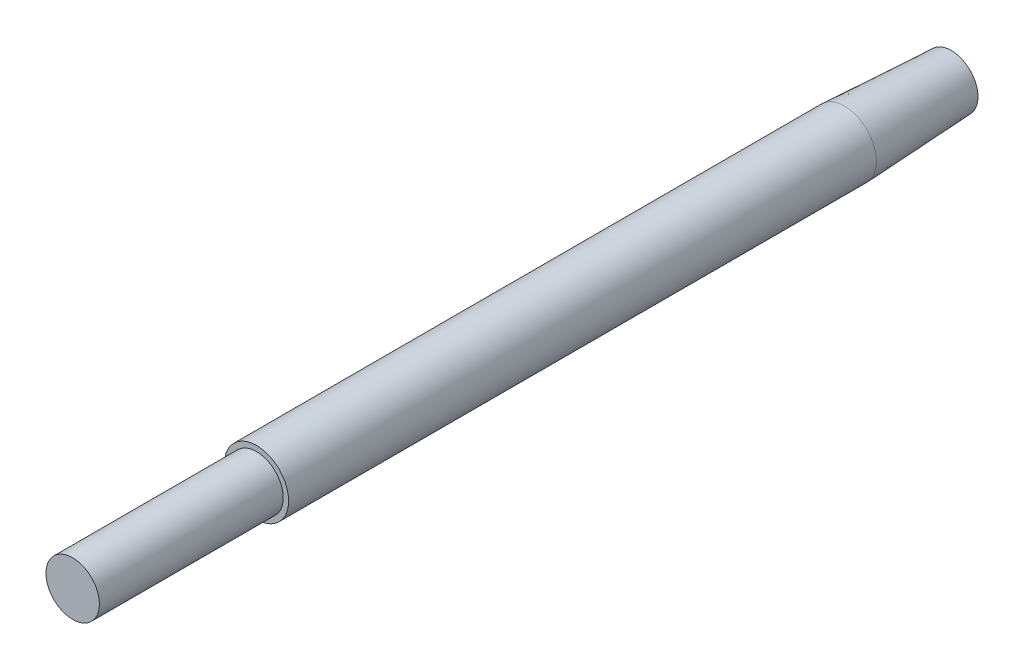
ISO-10303-21;
HEADER;
FILE_DESCRIPTION(('STEP AP214'),'2;1');
FILE_NAME('part.step','',(''),(''),'','','');
FILE_SCHEMA(('AUTOMOTIVE_DESIGN { 1 0 10303 214 1 1 1 1 }'));
ENDSEC;
DATA;
#1=APPLICATION_CONTEXT('core data for automotive mechanical design processes');
#2=APPLICATION_PROTOCOL_DEFINITION('international standard','automotive_design',2000,#1);
#3=PRODUCT_CONTEXT('',#1,'mechanical');
#4=PRODUCT('Part','Part','',(#3));
#5=PRODUCT_RELATED_PRODUCT_CATEGORY('part','',(#4));
#6=PRODUCT_DEFINITION_FORMATION('','',#4);
#7=PRODUCT_DEFINITION_CONTEXT('part definition',#1,'design');
#8=PRODUCT_DEFINITION('design','',#6,#7);
#9=PRODUCT_DEFINITION_SHAPE('','',#8);
#10=(LENGTH_UNIT() NAMED_UNIT(*) SI_UNIT(.MILLI.,.METRE.));
#11=(NAMED_UNIT(*) PLANE_ANGLE_UNIT() SI_UNIT($,.RADIAN.));
#12=(NAMED_UNIT(*) SI_UNIT($,.STERADIAN.) SOLID_ANGLE_UNIT());
#13=UNCERTAINTY_MEASURE_WITH_UNIT(LENGTH_MEASURE(1.E-05),#10,'distance_accuracy_value','');
#14=(GEOMETRIC_REPRESENTATION_CONTEXT(3) GLOBAL_UNCERTAINTY_ASSIGNED_CONTEXT((#13)) GLOBAL_UNIT_ASSIGNED_CONTEXT((#10,
#11,#12)) REPRESENTATION_CONTEXT('',''));
#15=CARTESIAN_POINT('',(0.,0.,0.));
#16=DIRECTION('',(0.,0.,1.));
#17=DIRECTION('',(1.,0.,0.));
#18=AXIS2_PLACEMENT_3D('',#15,#16,#17);
#19=CARTESIAN_POINT('',(0.,0.,205.5));
#20=DIRECTION('',(0.,0.,-1.));
#21=DIRECTION('',(-1.,0.,0.));
#22=AXIS2_PLACEMENT_3D('',#19,#20,#21);
#23=CYLINDRICAL_SURFACE('',#22,15.);
#24=CARTESIAN_POINT('',(0.,0.,-155.5));
#25=DIRECTION('',(0.,0.,1.));
#26=DIRECTION('',(1.,0.,0.));
#27=AXIS2_PLACEMENT_3D('',#24,#25,#26);
#28=CIRCLE('',#27,15.);
#29=CARTESIAN_POINT('',(15.,0.,-155.5));
#30=VERTEX_POINT('',#29);
#31=EDGE_CURVE('E11',#30,#30,#28,.F.);
#32=ORIENTED_EDGE('',*,*,#31,.F.);
#33=EDGE_LOOP('',(#32));
#34=FACE_BOUND('',#33,.T.);
#35=CARTESIAN_POINT('',(0.,0.,119.5));
#36=DIRECTION('',(0.,0.,1.));
#37=DIRECTION('',(1.,0.,0.));
#38=AXIS2_PLACEMENT_3D('',#35,#36,#37);
#39=CIRCLE('',#38,15.);
#40=CARTESIAN_POINT('',(15.,0.,119.5));
#41=VERTEX_POINT('',#40);
#42=EDGE_CURVE('E56',#41,#41,#39,.T.);
#43=ORIENTED_EDGE('',*,*,#42,.F.);
#44=EDGE_LOOP('',(#43));
#45=FACE_BOUND('',#44,.T.);
#46=ADVANCED_FACE('F46',(#34,#45),#23,.T.);
#47=CARTESIAN_POINT('',(0.,0.,119.5));
#48=DIRECTION('',(0.,0.,1.));
#49=DIRECTION('',(1.,0.,0.));
#50=AXIS2_PLACEMENT_3D('',#47,#48,#49);
#51=PLANE('',#50);
#52=CARTESIAN_POINT('',(0.,0.,119.5));
#53=DIRECTION('',(0.,0.,1.));
#54=DIRECTION('',(1.,0.,0.));
#55=AXIS2_PLACEMENT_3D('',#52,#53,#54);
#56=CIRCLE('',#55,12.5);
#57=CARTESIAN_POINT('',(12.5,0.,119.5));
#58=VERTEX_POINT('',#57);
#59=EDGE_CURVE('E60',#58,#58,#56,.T.);
#60=ORIENTED_EDGE('',*,*,#59,.F.);
#61=EDGE_LOOP('',(#60));
#62=FACE_BOUND('',#61,.T.);
#63=ORIENTED_EDGE('',*,*,#42,.T.);
#64=EDGE_LOOP('',(#63));
#65=FACE_BOUND('',#64,.T.);
#66=ADVANCED_FACE('F72',(#62,#65),#51,.T.);
#67=CARTESIAN_POINT('',(0.,0.,119.5));
#68=DIRECTION('',(0.,0.,1.));
#69=DIRECTION('',(1.,0.,0.));
#70=AXIS2_PLACEMENT_3D('',#67,#68,#69);
#71=CYLINDRICAL_SURFACE('',#70,12.5);
#72=ORIENTED_EDGE('',*,*,#59,.T.);
#73=EDGE_LOOP('',(#72));
#74=FACE_BOUND('',#73,.T.);
#75=CARTESIAN_POINT('',(0.,0.,205.5));
#76=DIRECTION('',(0.,0.,1.));
#77=DIRECTION('',(1.,0.,0.));
#78=AXIS2_PLACEMENT_3D('',#75,#76,#77);
#79=CIRCLE('',#78,12.5);
#80=CARTESIAN_POINT('',(12.5,0.,205.5));
#81=VERTEX_POINT('',#80);
#82=EDGE_CURVE('E63',#81,#81,#79,.T.);
#83=ORIENTED_EDGE('',*,*,#82,.F.);
#84=EDGE_LOOP('',(#83));
#85=FACE_BOUND('',#84,.T.);
#86=ADVANCED_FACE('F69',(#74,#85),#71,.T.);
#87=CARTESIAN_POINT('',(0.,0.,205.5));
#88=DIRECTION('',(0.,0.,1.));
#89=DIRECTION('',(1.,0.,0.));
#90=AXIS2_PLACEMENT_3D('',#87,#88,#89);
#91=PLANE('',#90);
#92=ORIENTED_EDGE('',*,*,#82,.T.);
#93=EDGE_LOOP('',(#92));
#94=FACE_BOUND('',#93,.T.);
#95=ADVANCED_FACE('F88',(#94),#91,.T.);
#96=CARTESIAN_POINT('',(0.,0.,-205.5));
#97=DIRECTION('',(0.,0.,1.));
#98=DIRECTION('',(1.,0.,0.));
#99=AXIS2_PLACEMENT_3D('',#96,#97,#98);
#100=CONICAL_SURFACE('',#99,12.5,0.0499583957219426);
#101=ORIENTED_EDGE('',*,*,#31,.T.);
#102=EDGE_LOOP('',(#101));
#103=FACE_BOUND('',#102,.T.);
#104=CARTESIAN_POINT('',(0.,0.,-205.5));
#105=DIRECTION('',(0.,0.,1.));
#106=DIRECTION('',(1.,0.,0.));
#107=AXIS2_PLACEMENT_3D('',#104,#105,#106);
#108=CIRCLE('',#107,12.5);
#109=CARTESIAN_POINT('',(12.5,0.,-205.5));
#110=VERTEX_POINT('',#109);
#111=EDGE_CURVE('E52',#110,#110,#108,.T.);
#112=ORIENTED_EDGE('',*,*,#111,.T.);
#113=EDGE_LOOP('',(#112));
#114=FACE_BOUND('',#113,.T.);
#115=ADVANCED_FACE('F91',(#103,#114),#100,.T.);
#116=CARTESIAN_POINT('',(0.,0.,-205.5));
#117=DIRECTION('',(0.,0.,1.));
#118=DIRECTION('',(1.,0.,0.));
#119=AXIS2_PLACEMENT_3D('',#116,#117,#118);
#120=PLANE('',#119);
#121=ORIENTED_EDGE('',*,*,#111,.F.);
#122=EDGE_LOOP('',(#121));
#123=FACE_BOUND('',#122,.T.);
#124=ADVANCED_FACE('F95',(#123),#120,.F.);
#125=CLOSED_SHELL('',(#46,#66,#86,#95,#115,#124));
#126=MANIFOLD_SOLID_BREP('B2',#125);
#127=ADVANCED_BREP_SHAPE_REPRESENTATION('',(#18,#126),#14);
#128=SHAPE_DEFINITION_REPRESENTATION(#9,#127);
ENDSEC;
END-ISO-10303-21;
